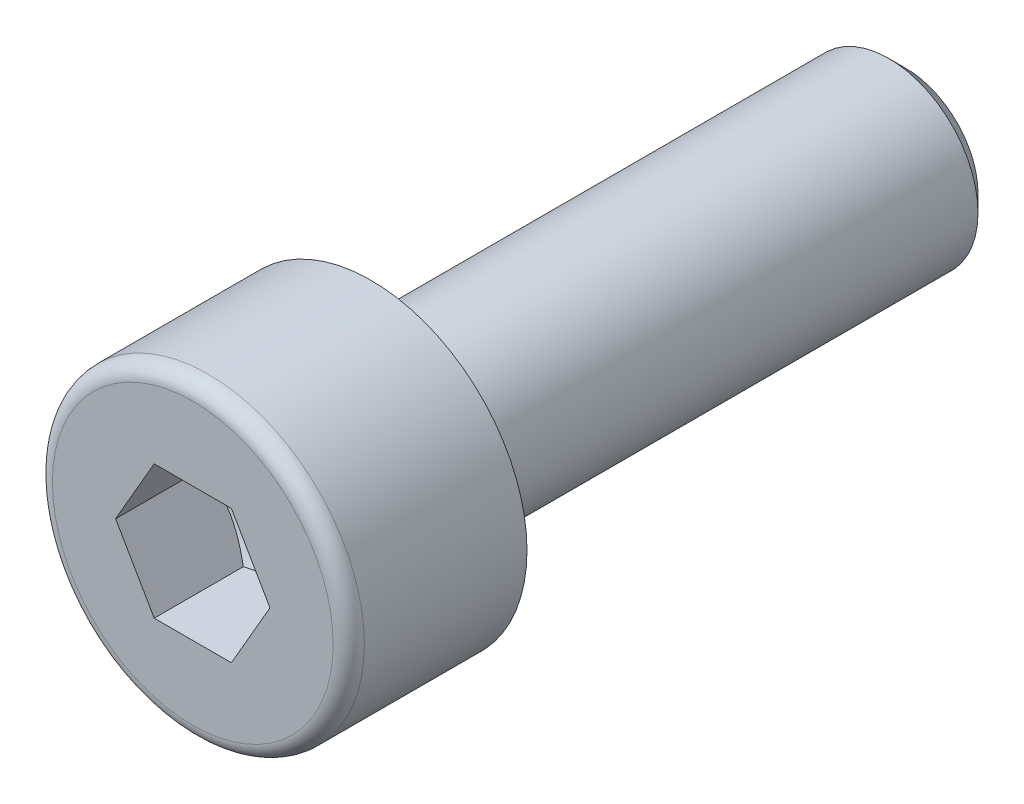
ISO-10303-21;
HEADER;
FILE_DESCRIPTION(('STEP AP214'),'2;1');
FILE_NAME('part.step','',(''),(''),'','','');
FILE_SCHEMA(('AUTOMOTIVE_DESIGN { 1 0 10303 214 1 1 1 1 }'));
ENDSEC;
DATA;
#1=APPLICATION_CONTEXT('core data for automotive mechanical design processes');
#2=APPLICATION_PROTOCOL_DEFINITION('international standard','automotive_design',2000,#1);
#3=PRODUCT_CONTEXT('',#1,'mechanical');
#4=PRODUCT('Part','Part','',(#3));
#5=PRODUCT_RELATED_PRODUCT_CATEGORY('part','',(#4));
#6=PRODUCT_DEFINITION_FORMATION('','',#4);
#7=PRODUCT_DEFINITION_CONTEXT('part definition',#1,'design');
#8=PRODUCT_DEFINITION('design','',#6,#7);
#9=PRODUCT_DEFINITION_SHAPE('','',#8);
#10=(LENGTH_UNIT() NAMED_UNIT(*) SI_UNIT(.MILLI.,.METRE.));
#11=(NAMED_UNIT(*) PLANE_ANGLE_UNIT() SI_UNIT($,.RADIAN.));
#12=(NAMED_UNIT(*) SI_UNIT($,.STERADIAN.) SOLID_ANGLE_UNIT());
#13=UNCERTAINTY_MEASURE_WITH_UNIT(LENGTH_MEASURE(1.E-05),#10,'distance_accuracy_value','');
#14=(GEOMETRIC_REPRESENTATION_CONTEXT(3) GLOBAL_UNCERTAINTY_ASSIGNED_CONTEXT((#13)) GLOBAL_UNIT_ASSIGNED_CONTEXT((#10,
#11,#12)) REPRESENTATION_CONTEXT('',''));
#15=CARTESIAN_POINT('',(0.,0.,0.));
#16=DIRECTION('',(0.,0.,1.));
#17=DIRECTION('',(1.,0.,0.));
#18=AXIS2_PLACEMENT_3D('',#15,#16,#17);
#19=CARTESIAN_POINT('',(0.,3.15,4.));
#20=DIRECTION('',(0.,0.,-1.));
#21=DIRECTION('',(-1.,0.,0.));
#22=AXIS2_PLACEMENT_3D('',#19,#20,#21);
#23=PLANE('',#22);
#24=CARTESIAN_POINT('',(0.,0.,4.));
#25=DIRECTION('',(0.,0.,1.));
#26=DIRECTION('',(1.,0.,0.));
#27=AXIS2_PLACEMENT_3D('',#24,#25,#26);
#28=CIRCLE('',#27,3.15);
#29=CARTESIAN_POINT('',(3.15,0.,4.));
#30=VERTEX_POINT('',#29);
#31=EDGE_CURVE('E125',#30,#30,#28,.T.);
#32=ORIENTED_EDGE('',*,*,#31,.T.);
#33=EDGE_LOOP('',(#32));
#34=FACE_BOUND('',#33,.T.);
#35=DIRECTION('',(0.5,-0.866025403784438,0.));
#36=VECTOR('',#35,1.);
#37=CARTESIAN_POINT('',(0.866025,1.49999930062484,4.));
#38=LINE('',#37,#36);
#39=CARTESIAN_POINT('',(0.866025,1.49999930062484,4.));
#40=VERTEX_POINT('',#39);
#41=CARTESIAN_POINT('',(1.73205,0.,4.));
#42=VERTEX_POINT('',#41);
#43=EDGE_CURVE('E31',#40,#42,#38,.T.);
#44=ORIENTED_EDGE('',*,*,#43,.T.);
#45=DIRECTION('',(-0.5,-0.866025403784439,0.));
#46=VECTOR('',#45,1.);
#47=CARTESIAN_POINT('',(1.73205,0.,4.));
#48=LINE('',#47,#46);
#49=CARTESIAN_POINT('',(0.866025,-1.49999930062484,4.));
#50=VERTEX_POINT('',#49);
#51=EDGE_CURVE('E172',#42,#50,#48,.T.);
#52=ORIENTED_EDGE('',*,*,#51,.T.);
#53=DIRECTION('',(-1.,0.,0.));
#54=VECTOR('',#53,1.);
#55=CARTESIAN_POINT('',(0.866025,-1.49999930062484,4.));
#56=LINE('',#55,#54);
#57=CARTESIAN_POINT('',(-0.866025,-1.49999930062484,4.));
#58=VERTEX_POINT('',#57);
#59=EDGE_CURVE('E177',#50,#58,#56,.T.);
#60=ORIENTED_EDGE('',*,*,#59,.T.);
#61=DIRECTION('',(-0.5,0.866025403784439,0.));
#62=VECTOR('',#61,1.);
#63=CARTESIAN_POINT('',(-0.866025,-1.49999930062484,4.));
#64=LINE('',#63,#62);
#65=CARTESIAN_POINT('',(-1.73205,0.,4.));
#66=VERTEX_POINT('',#65);
#67=EDGE_CURVE('E181',#58,#66,#64,.T.);
#68=ORIENTED_EDGE('',*,*,#67,.T.);
#69=DIRECTION('',(0.5,0.866025403784439,0.));
#70=VECTOR('',#69,1.);
#71=CARTESIAN_POINT('',(-1.73205,0.,4.));
#72=LINE('',#71,#70);
#73=CARTESIAN_POINT('',(-0.866025,1.49999930062484,4.));
#74=VERTEX_POINT('',#73);
#75=EDGE_CURVE('E103',#66,#74,#72,.T.);
#76=ORIENTED_EDGE('',*,*,#75,.T.);
#77=DIRECTION('',(1.,0.,0.));
#78=VECTOR('',#77,1.);
#79=CARTESIAN_POINT('',(-0.866025,1.49999930062484,4.));
#80=LINE('',#79,#78);
#81=EDGE_CURVE('E94',#74,#40,#80,.T.);
#82=ORIENTED_EDGE('',*,*,#81,.T.);
#83=EDGE_LOOP('',(#44,#52,#60,#68,#76,#82));
#84=FACE_BOUND('',#83,.T.);
#85=ADVANCED_FACE('F16',(#34,#84),#23,.F.);
#86=CARTESIAN_POINT('',(0.,0.,0.));
#87=DIRECTION('',(0.,0.,1.));
#88=DIRECTION('',(1.,0.,0.));
#89=AXIS2_PLACEMENT_3D('',#86,#87,#88);
#90=PLANE('',#89);
#91=CARTESIAN_POINT('',(0.,0.,0.));
#92=DIRECTION('',(0.,0.,1.));
#93=DIRECTION('',(1.,0.,0.));
#94=AXIS2_PLACEMENT_3D('',#91,#92,#93);
#95=CIRCLE('',#94,3.5);
#96=CARTESIAN_POINT('',(3.5,0.,0.));
#97=VERTEX_POINT('',#96);
#98=EDGE_CURVE('E24',#97,#97,#95,.T.);
#99=ORIENTED_EDGE('',*,*,#98,.F.);
#100=EDGE_LOOP('',(#99));
#101=FACE_BOUND('',#100,.T.);
#102=CARTESIAN_POINT('',(0.,0.,0.));
#103=DIRECTION('',(0.,0.,1.));
#104=DIRECTION('',(1.,0.,0.));
#105=AXIS2_PLACEMENT_3D('',#102,#103,#104);
#106=CIRCLE('',#105,2.);
#107=CARTESIAN_POINT('',(2.,0.,0.));
#108=VERTEX_POINT('',#107);
#109=EDGE_CURVE('E11',#108,#108,#106,.F.);
#110=ORIENTED_EDGE('',*,*,#109,.F.);
#111=EDGE_LOOP('',(#110));
#112=FACE_BOUND('',#111,.T.);
#113=ADVANCED_FACE('F140',(#101,#112),#90,.F.);
#114=CARTESIAN_POINT('',(0.,0.,4.));
#115=DIRECTION('',(0.,0.,1.));
#116=DIRECTION('',(1.,0.,0.));
#117=AXIS2_PLACEMENT_3D('',#114,#115,#116);
#118=CYLINDRICAL_SURFACE('',#117,3.5);
#119=CARTESIAN_POINT('',(0.,0.,3.65));
#120=DIRECTION('',(0.,0.,1.));
#121=DIRECTION('',(1.,0.,0.));
#122=AXIS2_PLACEMENT_3D('',#119,#120,#121);
#123=CIRCLE('',#122,3.5);
#124=CARTESIAN_POINT('',(3.5,0.,3.65));
#125=VERTEX_POINT('',#124);
#126=EDGE_CURVE('E129',#125,#125,#123,.T.);
#127=ORIENTED_EDGE('',*,*,#126,.F.);
#128=EDGE_LOOP('',(#127));
#129=FACE_BOUND('',#128,.T.);
#130=ORIENTED_EDGE('',*,*,#98,.T.);
#131=EDGE_LOOP('',(#130));
#132=FACE_BOUND('',#131,.T.);
#133=ADVANCED_FACE('F138',(#129,#132),#118,.T.);
#134=CARTESIAN_POINT('',(0.,0.,3.65));
#135=DIRECTION('',(0.,0.,1.));
#136=DIRECTION('',(1.,0.,0.));
#137=AXIS2_PLACEMENT_3D('',#134,#135,#136);
#138=TOROIDAL_SURFACE('',#137,3.15,0.35);
#139=ORIENTED_EDGE('',*,*,#31,.F.);
#140=EDGE_LOOP('',(#139));
#141=FACE_BOUND('',#140,.T.);
#142=ORIENTED_EDGE('',*,*,#126,.T.);
#143=EDGE_LOOP('',(#142));
#144=FACE_BOUND('',#143,.T.);
#145=ADVANCED_FACE('F148',(#141,#144),#138,.T.);
#146=CARTESIAN_POINT('',(0.,0.,0.));
#147=DIRECTION('',(0.,0.,1.));
#148=DIRECTION('',(1.,0.,0.));
#149=AXIS2_PLACEMENT_3D('',#146,#147,#148);
#150=CYLINDRICAL_SURFACE('',#149,2.);
#151=CARTESIAN_POINT('',(0.,0.,-11.621125));
#152=DIRECTION('',(0.,0.,1.));
#153=DIRECTION('',(1.,0.,0.));
#154=AXIS2_PLACEMENT_3D('',#151,#152,#153);
#155=CIRCLE('',#154,2.);
#156=CARTESIAN_POINT('',(2.,0.,-11.621125));
#157=VERTEX_POINT('',#156);
#158=EDGE_CURVE('E117',#157,#157,#155,.T.);
#159=ORIENTED_EDGE('',*,*,#158,.T.);
#160=EDGE_LOOP('',(#159));
#161=FACE_BOUND('',#160,.T.);
#162=ORIENTED_EDGE('',*,*,#109,.T.);
#163=EDGE_LOOP('',(#162));
#164=FACE_BOUND('',#163,.T.);
#165=ADVANCED_FACE('F145',(#161,#164),#150,.T.);
#166=CARTESIAN_POINT('',(0.,0.,-12.));
#167=DIRECTION('',(0.,0.,1.));
#168=DIRECTION('',(1.,0.,0.));
#169=AXIS2_PLACEMENT_3D('',#166,#167,#168);
#170=PLANE('',#169);
#171=CARTESIAN_POINT('',(0.,0.,-12.));
#172=DIRECTION('',(0.,0.,1.));
#173=DIRECTION('',(1.,0.,0.));
#174=AXIS2_PLACEMENT_3D('',#171,#172,#173);
#175=CIRCLE('',#174,1.621125);
#176=CARTESIAN_POINT('',(1.621125,0.,-12.));
#177=VERTEX_POINT('',#176);
#178=EDGE_CURVE('E121',#177,#177,#175,.T.);
#179=ORIENTED_EDGE('',*,*,#178,.F.);
#180=EDGE_LOOP('',(#179));
#181=FACE_BOUND('',#180,.T.);
#182=ADVANCED_FACE('F147',(#181),#170,.F.);
#183=CARTESIAN_POINT('',(0.,0.,-12.));
#184=DIRECTION('',(0.,0.,1.));
#185=DIRECTION('',(1.,0.,0.));
#186=AXIS2_PLACEMENT_3D('',#183,#184,#185);
#187=CONICAL_SURFACE('',#186,1.621125,0.785398163397445);
#188=ORIENTED_EDGE('',*,*,#158,.F.);
#189=EDGE_LOOP('',(#188));
#190=FACE_BOUND('',#189,.T.);
#191=ORIENTED_EDGE('',*,*,#178,.T.);
#192=EDGE_LOOP('',(#191));
#193=FACE_BOUND('',#192,.T.);
#194=ADVANCED_FACE('F156',(#190,#193),#187,.T.);
#195=CARTESIAN_POINT('',(0.866025,1.49999930062484,1.00000046625011));
#196=DIRECTION('',(-0.866025403784438,-0.5,0.));
#197=DIRECTION('',(-0.5,0.866025403784438,0.));
#198=AXIS2_PLACEMENT_3D('',#195,#196,#197);
#199=PLANE('',#198);
#200=DIRECTION('',(0.,0.,1.));
#201=VECTOR('',#200,1.);
#202=CARTESIAN_POINT('',(1.73205,0.,1.00000046625011));
#203=LINE('',#202,#201);
#204=CARTESIAN_POINT('',(1.73205,0.,2.));
#205=VERTEX_POINT('',#204);
#206=EDGE_CURVE('E115',#205,#42,#203,.T.);
#207=ORIENTED_EDGE('',*,*,#206,.T.);
#208=ORIENTED_EDGE('',*,*,#43,.F.);
#209=DIRECTION('',(0.,0.,1.));
#210=VECTOR('',#209,1.);
#211=CARTESIAN_POINT('',(0.866025,1.49999930062484,1.00000046625011));
#212=LINE('',#211,#210);
#213=CARTESIAN_POINT('',(0.866025,1.49999930062484,2.));
#214=VERTEX_POINT('',#213);
#215=EDGE_CURVE('E87',#214,#40,#212,.T.);
#216=ORIENTED_EDGE('',*,*,#215,.F.);
#217=CARTESIAN_POINT('',(1.73205115470054,-2.E-06,2.00000066666734));
#218=CARTESIAN_POINT('',(1.69399458130122,0.0659139186895892,1.97802228100261));
#219=CARTESIAN_POINT('',(1.65560950414464,0.132398822577242,1.95803408114054));
#220=CARTESIAN_POINT('',(1.57817473630843,0.266519774741864,1.92314525941874));
#221=CARTESIAN_POINT('',(1.53912367019894,0.334158205333232,1.90825697858766));
#222=CARTESIAN_POINT('',(1.46150547885139,0.468596856338784,1.88508226983918));
#223=CARTESIAN_POINT('',(1.42295029290091,0.535376397300293,1.87664158385231));
#224=CARTESIAN_POINT('',(1.34565859846878,0.669249539059823,1.86656700525616));
#225=CARTESIAN_POINT('',(1.30692237073331,0.736342653591208,1.86492476807133));
#226=CARTESIAN_POINT('',(1.23454773253413,0.861699204131607,1.86834969801067));
#227=CARTESIAN_POINT('',(1.20089846229767,0.919981449818777,1.87257593125167));
#228=CARTESIAN_POINT('',(1.1338191361032,1.03616625092508,1.88596796669928));
#229=CARTESIAN_POINT('',(1.10038931198579,1.09406840478452,1.89513833923059));
#230=CARTESIAN_POINT('',(1.03317179328088,1.21049256234014,1.91806252128818));
#231=CARTESIAN_POINT('',(0.999392601793287,1.26899983823525,1.93191346069662));
#232=CARTESIAN_POINT('',(0.932337893068965,1.38514200063251,1.96334924731355));
#233=CARTESIAN_POINT('',(0.89906151743008,1.4427783739308,1.980926712986));
#234=CARTESIAN_POINT('',(0.866023845299461,1.50000130062484,2.00000066666734));
#235=B_SPLINE_CURVE_WITH_KNOTS('',3,(#217,#218,#219,#220,#221,#222,#223,#224,#225,#226,#227,
#228,#229,#230,#231,#232,#233,#234),.UNSPECIFIED.,.F.,.F.,(4,2,2,2,2,2,2,2,4),(0.,
0.237762055931485,0.476095461361748,0.708530837844131,0.94068083294838,1.14278193102308,
1.34507017093339,1.55184422617205,1.75821246569164),.UNSPECIFIED.);
#236=EDGE_CURVE('E79',#205,#214,#235,.T.);
#237=ORIENTED_EDGE('',*,*,#236,.F.);
#238=EDGE_LOOP('',(#207,#208,#216,#237));
#239=FACE_BOUND('',#238,.T.);
#240=ADVANCED_FACE('F88',(#239),#199,.T.);
#241=CARTESIAN_POINT('',(1.73205,0.,1.00000046625011));
#242=DIRECTION('',(-0.866025403784439,0.5,0.));
#243=DIRECTION('',(0.5,0.866025403784439,0.));
#244=AXIS2_PLACEMENT_3D('',#241,#242,#243);
#245=PLANE('',#244);
#246=DIRECTION('',(0.,0.,1.));
#247=VECTOR('',#246,1.);
#248=CARTESIAN_POINT('',(0.866025,-1.49999930062484,1.00000046625011));
#249=LINE('',#248,#247);
#250=CARTESIAN_POINT('',(0.866025,-1.49999930062484,2.));
#251=VERTEX_POINT('',#250);
#252=EDGE_CURVE('E112',#251,#50,#249,.T.);
#253=ORIENTED_EDGE('',*,*,#252,.T.);
#254=ORIENTED_EDGE('',*,*,#51,.F.);
#255=ORIENTED_EDGE('',*,*,#206,.F.);
#256=CARTESIAN_POINT('',(0.866023845299462,-1.50000130062484,2.00000066666734));
#257=CARTESIAN_POINT('',(0.904080418698778,-1.43408538193525,1.9780222810026));
#258=CARTESIAN_POINT('',(0.942465495855361,-1.36760047804759,1.95803408114054));
#259=CARTESIAN_POINT('',(1.01990026369157,-1.23347952588297,1.92314525941874));
#260=CARTESIAN_POINT('',(1.05895132980106,-1.1658410952916,1.90825697858766));
#261=CARTESIAN_POINT('',(1.13656952114861,-1.03140244428605,1.88508226983918));
#262=CARTESIAN_POINT('',(1.1751247070991,-0.964622903324544,1.87664158385231));
#263=CARTESIAN_POINT('',(1.25241640153122,-0.830749761565014,1.86656700525616));
#264=CARTESIAN_POINT('',(1.29115262926669,-0.763656647033629,1.86492476807133));
#265=CARTESIAN_POINT('',(1.36352726746587,-0.638300096493229,1.86834969801067));
#266=CARTESIAN_POINT('',(1.39717653770233,-0.58001785080606,1.87257593125166));
#267=CARTESIAN_POINT('',(1.4642558638968,-0.463833049699756,1.88596796669928));
#268=CARTESIAN_POINT('',(1.49768568801421,-0.405930895840313,1.89513833923059));
#269=CARTESIAN_POINT('',(1.56490320671912,-0.2895067382847,1.91806252128818));
#270=CARTESIAN_POINT('',(1.59868239820671,-0.230999462389588,1.93191346069662));
#271=CARTESIAN_POINT('',(1.66573710693103,-0.11485729999233,1.96334924731355));
#272=CARTESIAN_POINT('',(1.69901348256992,-0.0572209266940348,1.980926712986));
#273=CARTESIAN_POINT('',(1.73205115470054,1.99999999979098E-06,2.00000066666734));
#274=B_SPLINE_CURVE_WITH_KNOTS('',3,(#256,#257,#258,#259,#260,#261,#262,#263,#264,#265,#266,
#267,#268,#269,#270,#271,#272,#273),.UNSPECIFIED.,.F.,.F.,(4,2,2,2,2,2,2,2,4),(0.,
0.237762055931484,0.476095461361747,0.708530837844129,0.940680832948377,1.14278193102307,
1.34507017093338,1.55184422617205,1.75821246569164),.UNSPECIFIED.);
#275=EDGE_CURVE('E83',#251,#205,#274,.T.);
#276=ORIENTED_EDGE('',*,*,#275,.F.);
#277=EDGE_LOOP('',(#253,#254,#255,#276));
#278=FACE_BOUND('',#277,.T.);
#279=ADVANCED_FACE('F237',(#278),#245,.T.);
#280=CARTESIAN_POINT('',(0.866025,-1.49999930062484,1.00000046625011));
#281=DIRECTION('',(0.,1.,0.));
#282=DIRECTION('',(1.,0.,0.));
#283=AXIS2_PLACEMENT_3D('',#280,#281,#282);
#284=PLANE('',#283);
#285=DIRECTION('',(0.,0.,1.));
#286=VECTOR('',#285,1.);
#287=CARTESIAN_POINT('',(-0.866025,-1.49999930062484,1.00000046625011));
#288=LINE('',#287,#286);
#289=CARTESIAN_POINT('',(-0.866025,-1.49999930062484,2.));
#290=VERTEX_POINT('',#289);
#291=EDGE_CURVE('E109',#290,#58,#288,.T.);
#292=ORIENTED_EDGE('',*,*,#291,.T.);
#293=ORIENTED_EDGE('',*,*,#59,.F.);
#294=ORIENTED_EDGE('',*,*,#252,.F.);
#295=CARTESIAN_POINT('',(-2.24271663728987,-1.49999930062484,2.55775267344395));
#296=CARTESIAN_POINT('',(-2.17794141332338,-1.49999930062484,2.52667596135368));
#297=CARTESIAN_POINT('',(-2.11300852130655,-1.49999930062484,2.49592211621229));
#298=CARTESIAN_POINT('',(-1.98274303131292,-1.49999930062484,2.43524311162405));
#299=CARTESIAN_POINT('',(-1.91741036395219,-1.49999930062484,2.40531810131238));
#300=CARTESIAN_POINT('',(-1.78588635397686,-1.49999930062484,2.34631254095844));
#301=CARTESIAN_POINT('',(-1.71969220663993,-1.49999930062484,2.31723821458641));
#302=CARTESIAN_POINT('',(-1.58674953026847,-1.49999930062484,2.26039396688304));
#303=CARTESIAN_POINT('',(-1.52000103027226,-1.49999930062484,2.23262397772829));
#304=CARTESIAN_POINT('',(-1.38408036083489,-1.49999930062484,2.17802545642731));
#305=CARTESIAN_POINT('',(-1.31489044686774,-1.49999930062484,2.1512405113674));
#306=CARTESIAN_POINT('',(-1.17568875836751,-1.49999930062484,2.09990652822181));
#307=CARTESIAN_POINT('',(-1.10567688208708,-1.49999930062484,2.07535777031023));
#308=CARTESIAN_POINT('',(-0.894522216300188,-1.49999930062484,2.0061010834001));
#309=CARTESIAN_POINT('',(-0.751873977094198,-1.49999930062484,1.9656202744164));
#310=CARTESIAN_POINT('',(-0.535047450977606,-1.49999930062484,1.9186645261203));
#311=CARTESIAN_POINT('',(-0.462365424606466,-1.49999930062484,1.90531291688069));
#312=CARTESIAN_POINT('',(-0.316183762847225,-1.49999930062484,1.8841134767258));
#313=CARTESIAN_POINT('',(-0.242684183051902,-1.49999930062484,1.87626527388084));
#314=CARTESIAN_POINT('',(-0.0961588910059515,-1.49999930062484,1.86679859934064));
#315=CARTESIAN_POINT('',(-0.0231380525234333,-1.49999930062484,1.86510661239957));
#316=CARTESIAN_POINT('',(0.122783022434076,-1.49999930062484,1.86789948707645));
#317=CARTESIAN_POINT('',(0.195683251161583,-1.49999930062484,1.8723847311637));
#318=CARTESIAN_POINT('',(0.375553746438775,-1.49999930062484,1.89067768491976));
#319=CARTESIAN_POINT('',(0.4821754471692,-1.49999930062484,1.90791354190592));
#320=CARTESIAN_POINT('',(0.693345462539466,-1.49999930062484,1.95235984396466));
#321=CARTESIAN_POINT('',(0.79789111749796,-1.49999930062484,1.97958231080908));
#322=CARTESIAN_POINT('',(0.954250638010105,-1.49999930062484,2.02608493590371));
#323=CARTESIAN_POINT('',(1.00687274480645,-1.49999930062484,2.04274751774646));
#324=CARTESIAN_POINT('',(1.11156919647057,-1.49999930062484,2.07761406562061));
#325=CARTESIAN_POINT('',(1.16364386068557,-1.49999930062484,2.09581706970924));
#326=CARTESIAN_POINT('',(1.26731501755411,-1.49999930062484,2.13350010092581));
#327=CARTESIAN_POINT('',(1.31891159517315,-1.49999930062484,2.15297989597396));
#328=CARTESIAN_POINT('',(1.42169818698628,-1.49999930062484,2.19300580386973));
#329=CARTESIAN_POINT('',(1.47288813079445,-1.49999930062484,2.21355209687612));
#330=CARTESIAN_POINT('',(1.6035520536722,-1.49999930062484,2.26731329701247));
#331=CARTESIAN_POINT('',(1.68276476914258,-1.49999930062484,2.30116251352867));
#332=CARTESIAN_POINT('',(1.84047488481565,-1.49999930062484,2.37049266735));
#333=CARTESIAN_POINT('',(1.9189722309026,-1.49999930062484,2.40597372689195));
#334=CARTESIAN_POINT('',(2.15362957255391,-1.49999930062484,2.51428942992019));
#335=CARTESIAN_POINT('',(2.3089286607519,-1.49999930062484,2.58898549353906));
#336=CARTESIAN_POINT('',(2.61820006623532,-1.49999930062484,2.74151036059574));
#337=CARTESIAN_POINT('',(2.77217051778771,-1.49999930062484,2.81934290231597));
#338=CARTESIAN_POINT('',(3.07905650209162,-1.49999930062484,2.97700931547993));
#339=CARTESIAN_POINT('',(3.23197216581148,-1.49999930062484,3.05684293253984));
#340=CARTESIAN_POINT('',(3.52267476728495,-1.49999930062484,3.21028853935711));
#341=CARTESIAN_POINT('',(3.66052737206612,-1.49999930062484,3.28377655462836));
#342=CARTESIAN_POINT('',(3.93578914881928,-1.49999930062484,3.43158990958268));
#343=CARTESIAN_POINT('',(4.07319830413762,-1.49999930062484,3.50591528025237));
#344=CARTESIAN_POINT('',(4.34732590427536,-1.49999930062483,3.65500351537988));
#345=CARTESIAN_POINT('',(4.48404521696312,-1.49999930062483,3.72976478622522));
#346=CARTESIAN_POINT('',(4.75720742747683,-1.49999930062483,3.87977391809883));
#347=CARTESIAN_POINT('',(4.89365033939364,-1.49999930062484,3.9550217534582));
#348=CARTESIAN_POINT('',(5.02999394665514,-1.49999930062484,4.03044801324502));
#349=B_SPLINE_CURVE_WITH_KNOTS('',3,(#295,#296,#297,#298,#299,#300,#301,#302,#303,#304,#305,
#306,#307,#308,#309,#310,#311,#312,#313,#314,#315,#316,#317,#318,#319,#320,#321,#322,#323,#324,
#325,#326,#327,#328,#329,#330,#331,#332,#333,#334,#335,#336,#337,#338,#339,#340,#341,#342,#343,
#344,#345,#346,#347,#348),.UNSPECIFIED.,.F.,.F.,(4,2,2,2,2,2,2,2,2,2,2,2,2,2,2,2,2,2,2,2,2,2,2,
2,2,2,4),(0.,0.215535408976475,0.431109351318747,0.647990972858705,0.864861304394723,
1.08740082372431,1.30996818700982,1.75384735851117,1.97537373294937,2.19688513480997,
2.41574248382684,2.63461338422016,2.95796620171825,3.28170955197757,3.44728283297626,
3.61275347131505,3.77819411534645,3.94366279806486,4.20206179692704,4.46048018336434,
4.97740230798824,5.49495989978084,6.01245202818902,6.48110050133562,6.94976637432356,
7.41724019162004,7.88468954517039),.UNSPECIFIED.);
#350=EDGE_CURVE('E225',#290,#251,#349,.T.);
#351=ORIENTED_EDGE('',*,*,#350,.F.);
#352=EDGE_LOOP('',(#292,#293,#294,#351));
#353=FACE_BOUND('',#352,.T.);
#354=ADVANCED_FACE('F232',(#353),#284,.T.);
#355=CARTESIAN_POINT('',(-0.866025,-1.49999930062484,1.00000046625011));
#356=DIRECTION('',(0.866025403784439,0.5,0.));
#357=DIRECTION('',(0.5,-0.866025403784439,0.));
#358=AXIS2_PLACEMENT_3D('',#355,#356,#357);
#359=PLANE('',#358);
#360=DIRECTION('',(0.,0.,1.));
#361=VECTOR('',#360,1.);
#362=CARTESIAN_POINT('',(-1.73205,0.,1.00000046625011));
#363=LINE('',#362,#361);
#364=CARTESIAN_POINT('',(-1.73205,0.,2.));
#365=VERTEX_POINT('',#364);
#366=EDGE_CURVE('E100',#365,#66,#363,.T.);
#367=ORIENTED_EDGE('',*,*,#366,.T.);
#368=ORIENTED_EDGE('',*,*,#67,.F.);
#369=ORIENTED_EDGE('',*,*,#291,.F.);
#370=CARTESIAN_POINT('',(-1.73205115470054,1.99999999935948E-06,2.00000066666734));
#371=CARTESIAN_POINT('',(-1.69399458130122,-0.0659139186895897,1.97802228100261));
#372=CARTESIAN_POINT('',(-1.65560950414464,-0.132398822577242,1.95803408114054));
#373=CARTESIAN_POINT('',(-1.57817473630843,-0.266519774741865,1.92314525941874));
#374=CARTESIAN_POINT('',(-1.53912367019894,-0.334158205333233,1.90825697858766));
#375=CARTESIAN_POINT('',(-1.46150547885139,-0.468596856338785,1.88508226983918));
#376=CARTESIAN_POINT('',(-1.4229502929009,-0.535376397300293,1.87664158385231));
#377=CARTESIAN_POINT('',(-1.34565859846878,-0.669249539059823,1.86656700525616));
#378=CARTESIAN_POINT('',(-1.30692237073331,-0.736342653591209,1.86492476807133));
#379=CARTESIAN_POINT('',(-1.23454773253413,-0.861699204131608,1.86834969801067));
#380=CARTESIAN_POINT('',(-1.20089846229767,-0.919981449818777,1.87257593125166));
#381=CARTESIAN_POINT('',(-1.1338191361032,-1.03616625092508,1.88596796669928));
#382=CARTESIAN_POINT('',(-1.10038931198579,-1.09406840478452,1.89513833923059));
#383=CARTESIAN_POINT('',(-1.03317179328088,-1.21049256234014,1.91806252128818));
#384=CARTESIAN_POINT('',(-0.999392601793289,-1.26899983823525,1.93191346069662));
#385=CARTESIAN_POINT('',(-0.932337893068967,-1.38514200063251,1.96334924731355));
#386=CARTESIAN_POINT('',(-0.899061517430081,-1.4427783739308,1.980926712986));
#387=CARTESIAN_POINT('',(-0.866023845299461,-1.50000130062484,2.00000066666734));
#388=B_SPLINE_CURVE_WITH_KNOTS('',3,(#370,#371,#372,#373,#374,#375,#376,#377,#378,#379,#380,
#381,#382,#383,#384,#385,#386,#387),.UNSPECIFIED.,.F.,.F.,(4,2,2,2,2,2,2,2,4),(0.,
0.237762055931485,0.476095461361749,0.708530837844132,0.94068083294838,1.14278193102308,
1.34507017093338,1.55184422617205,1.75821246569164),.UNSPECIFIED.);
#389=EDGE_CURVE('E218',#365,#290,#388,.T.);
#390=ORIENTED_EDGE('',*,*,#389,.F.);
#391=EDGE_LOOP('',(#367,#368,#369,#390));
#392=FACE_BOUND('',#391,.T.);
#393=ADVANCED_FACE('F201',(#392),#359,.T.);
#394=CARTESIAN_POINT('',(-1.73205,0.,1.00000046625011));
#395=DIRECTION('',(0.866025403784439,-0.5,0.));
#396=DIRECTION('',(-0.5,-0.866025403784439,0.));
#397=AXIS2_PLACEMENT_3D('',#394,#395,#396);
#398=PLANE('',#397);
#399=DIRECTION('',(0.,0.,1.));
#400=VECTOR('',#399,1.);
#401=CARTESIAN_POINT('',(-0.866025,1.49999930062484,1.00000046625011));
#402=LINE('',#401,#400);
#403=CARTESIAN_POINT('',(-0.866025,1.49999930062484,2.));
#404=VERTEX_POINT('',#403);
#405=EDGE_CURVE('E93',#404,#74,#402,.T.);
#406=ORIENTED_EDGE('',*,*,#405,.T.);
#407=ORIENTED_EDGE('',*,*,#75,.F.);
#408=ORIENTED_EDGE('',*,*,#366,.F.);
#409=CARTESIAN_POINT('',(-0.866023845299462,1.50000130062484,2.00000066666734));
#410=CARTESIAN_POINT('',(-0.904080418698778,1.43408538193525,1.9780222810026));
#411=CARTESIAN_POINT('',(-0.942465495855361,1.36760047804759,1.95803408114054));
#412=CARTESIAN_POINT('',(-1.01990026369157,1.23347952588297,1.92314525941874));
#413=CARTESIAN_POINT('',(-1.05895132980106,1.1658410952916,1.90825697858766));
#414=CARTESIAN_POINT('',(-1.13656952114861,1.03140244428605,1.88508226983918));
#415=CARTESIAN_POINT('',(-1.1751247070991,0.964622903324544,1.87664158385231));
#416=CARTESIAN_POINT('',(-1.25241640153122,0.830749761565014,1.86656700525616));
#417=CARTESIAN_POINT('',(-1.29115262926669,0.763656647033629,1.86492476807133));
#418=CARTESIAN_POINT('',(-1.36352726746587,0.638300096493229,1.86834969801067));
#419=CARTESIAN_POINT('',(-1.39717653770233,0.58001785080606,1.87257593125166));
#420=CARTESIAN_POINT('',(-1.4642558638968,0.463833049699756,1.88596796669928));
#421=CARTESIAN_POINT('',(-1.49768568801421,0.405930895840313,1.89513833923059));
#422=CARTESIAN_POINT('',(-1.56490320671912,0.289506738284699,1.91806252128818));
#423=CARTESIAN_POINT('',(-1.59868239820671,0.230999462389588,1.93191346069662));
#424=CARTESIAN_POINT('',(-1.66573710693103,0.11485729999233,1.96334924731355));
#425=CARTESIAN_POINT('',(-1.69901348256992,0.0572209266940344,1.980926712986));
#426=CARTESIAN_POINT('',(-1.73205115470054,-2.00000000048508E-06,2.00000066666734));
#427=B_SPLINE_CURVE_WITH_KNOTS('',3,(#409,#410,#411,#412,#413,#414,#415,#416,#417,#418,#419,
#420,#421,#422,#423,#424,#425,#426),.UNSPECIFIED.,.F.,.F.,(4,2,2,2,2,2,2,2,4),(0.,
0.237762055931484,0.476095461361747,0.708530837844129,0.940680832948377,1.14278193102307,
1.34507017093338,1.55184422617205,1.75821246569164),.UNSPECIFIED.);
#428=EDGE_CURVE('E39',#404,#365,#427,.T.);
#429=ORIENTED_EDGE('',*,*,#428,.F.);
#430=EDGE_LOOP('',(#406,#407,#408,#429));
#431=FACE_BOUND('',#430,.T.);
#432=ADVANCED_FACE('F195',(#431),#398,.T.);
#433=CARTESIAN_POINT('',(-0.866025,1.49999930062484,1.00000046625011));
#434=DIRECTION('',(0.,-1.,0.));
#435=DIRECTION('',(-1.,0.,0.));
#436=AXIS2_PLACEMENT_3D('',#433,#434,#435);
#437=PLANE('',#436);
#438=ORIENTED_EDGE('',*,*,#215,.T.);
#439=ORIENTED_EDGE('',*,*,#81,.F.);
#440=ORIENTED_EDGE('',*,*,#405,.F.);
#441=CARTESIAN_POINT('',(-2.24271663728987,1.49999930062484,2.55775267344395));
#442=CARTESIAN_POINT('',(-2.17794141332338,1.49999930062484,2.52667596135368));
#443=CARTESIAN_POINT('',(-2.11300852130655,1.49999930062484,2.49592211621229));
#444=CARTESIAN_POINT('',(-1.98274303131292,1.49999930062484,2.43524311162405));
#445=CARTESIAN_POINT('',(-1.91741036395219,1.49999930062484,2.40531810131238));
#446=CARTESIAN_POINT('',(-1.78588635397687,1.49999930062484,2.34631254095844));
#447=CARTESIAN_POINT('',(-1.71969220663993,1.49999930062484,2.31723821458641));
#448=CARTESIAN_POINT('',(-1.58674953026847,1.49999930062484,2.26039396688304));
#449=CARTESIAN_POINT('',(-1.52000103027226,1.49999930062484,2.23262397772829));
#450=CARTESIAN_POINT('',(-1.3840803608349,1.49999930062484,2.17802545642731));
#451=CARTESIAN_POINT('',(-1.31489044686775,1.49999930062484,2.1512405113674));
#452=CARTESIAN_POINT('',(-1.17568875836751,1.49999930062484,2.09990652822181));
#453=CARTESIAN_POINT('',(-1.10567688208708,1.49999930062484,2.07535777031023));
#454=CARTESIAN_POINT('',(-0.894522216300189,1.49999930062484,2.0061010834001));
#455=CARTESIAN_POINT('',(-0.751873977094199,1.49999930062484,1.9656202744164));
#456=CARTESIAN_POINT('',(-0.535047450977607,1.49999930062484,1.9186645261203));
#457=CARTESIAN_POINT('',(-0.462365424606467,1.49999930062484,1.90531291688069));
#458=CARTESIAN_POINT('',(-0.316183762847226,1.49999930062484,1.8841134767258));
#459=CARTESIAN_POINT('',(-0.242684183051903,1.49999930062484,1.87626527388084));
#460=CARTESIAN_POINT('',(-0.0961588910059524,1.49999930062484,1.86679859934064));
#461=CARTESIAN_POINT('',(-0.0231380525234342,1.49999930062484,1.86510661239957));
#462=CARTESIAN_POINT('',(0.122783022434075,1.49999930062484,1.86789948707645));
#463=CARTESIAN_POINT('',(0.195683251161582,1.49999930062484,1.8723847311637));
#464=CARTESIAN_POINT('',(0.375553746438774,1.49999930062484,1.89067768491976));
#465=CARTESIAN_POINT('',(0.482175447169199,1.49999930062484,1.90791354190592));
#466=CARTESIAN_POINT('',(0.693345462539464,1.49999930062484,1.95235984396466));
#467=CARTESIAN_POINT('',(0.797891117497957,1.49999930062484,1.97958231080908));
#468=CARTESIAN_POINT('',(0.954250638010102,1.49999930062484,2.02608493590371));
#469=CARTESIAN_POINT('',(1.00687274480645,1.49999930062484,2.04274751774646));
#470=CARTESIAN_POINT('',(1.11156919647056,1.49999930062484,2.07761406562061));
#471=CARTESIAN_POINT('',(1.16364386068556,1.49999930062484,2.09581706970924));
#472=CARTESIAN_POINT('',(1.2673150175541,1.49999930062484,2.13350010092581));
#473=CARTESIAN_POINT('',(1.31891159517315,1.49999930062484,2.15297989597396));
#474=CARTESIAN_POINT('',(1.42169818698628,1.49999930062484,2.19300580386972));
#475=CARTESIAN_POINT('',(1.47288813079445,1.49999930062484,2.21355209687612));
#476=CARTESIAN_POINT('',(1.60355205367219,1.49999930062484,2.26731329701247));
#477=CARTESIAN_POINT('',(1.68276476914257,1.49999930062484,2.30116251352867));
#478=CARTESIAN_POINT('',(1.84047488481565,1.49999930062484,2.37049266735));
#479=CARTESIAN_POINT('',(1.91897223090259,1.49999930062484,2.40597372689195));
#480=CARTESIAN_POINT('',(2.15362957255391,1.49999930062484,2.51428942992019));
#481=CARTESIAN_POINT('',(2.30892866075189,1.49999930062484,2.58898549353906));
#482=CARTESIAN_POINT('',(2.61820006623532,1.49999930062484,2.74151036059574));
#483=CARTESIAN_POINT('',(2.77217051778771,1.49999930062484,2.81934290231597));
#484=CARTESIAN_POINT('',(3.07905650209162,1.49999930062484,2.97700931547993));
#485=CARTESIAN_POINT('',(3.23197216581148,1.49999930062484,3.05684293253984));
#486=CARTESIAN_POINT('',(3.52267476728495,1.49999930062484,3.21028853935711));
#487=CARTESIAN_POINT('',(3.66052737206611,1.49999930062484,3.28377655462836));
#488=CARTESIAN_POINT('',(3.93578914881928,1.49999930062484,3.43158990958268));
#489=CARTESIAN_POINT('',(4.07319830413762,1.49999930062484,3.50591528025237));
#490=CARTESIAN_POINT('',(4.34732590427536,1.49999930062484,3.65500351537988));
#491=CARTESIAN_POINT('',(4.48404521696312,1.49999930062484,3.72976478622523));
#492=CARTESIAN_POINT('',(4.75720742747683,1.49999930062484,3.87977391809883));
#493=CARTESIAN_POINT('',(4.89365033939364,1.49999930062484,3.9550217534582));
#494=CARTESIAN_POINT('',(5.02999394665514,1.49999930062484,4.03044801324502));
#495=B_SPLINE_CURVE_WITH_KNOTS('',3,(#441,#442,#443,#444,#445,#446,#447,#448,#449,#450,#451,
#452,#453,#454,#455,#456,#457,#458,#459,#460,#461,#462,#463,#464,#465,#466,#467,#468,#469,#470,
#471,#472,#473,#474,#475,#476,#477,#478,#479,#480,#481,#482,#483,#484,#485,#486,#487,#488,#489,
#490,#491,#492,#493,#494),.UNSPECIFIED.,.F.,.F.,(4,2,2,2,2,2,2,2,2,2,2,2,2,2,2,2,2,2,2,2,2,2,2,
2,2,2,4),(0.,0.215535408976474,0.431109351318746,0.647990972858704,0.864861304394721,
1.0874008237243,1.30996818700982,1.75384735851117,1.97537373294937,2.19688513480997,
2.41574248382684,2.63461338422015,2.95796620171825,3.28170955197757,3.44728283297626,
3.61275347131505,3.77819411534645,3.94366279806485,4.20206179692704,4.46048018336433,
4.97740230798824,5.49495989978084,6.01245202818902,6.48110050133561,6.94976637432355,
7.41724019162004,7.88468954517039),.UNSPECIFIED.);
#496=EDGE_CURVE('E80',#214,#404,#495,.F.);
#497=ORIENTED_EDGE('',*,*,#496,.F.);
#498=EDGE_LOOP('',(#438,#439,#440,#497));
#499=FACE_BOUND('',#498,.T.);
#500=ADVANCED_FACE('F75',(#499),#437,.T.);
#501=CARTESIAN_POINT('',(0.,0.,1.00000046625011));
#502=DIRECTION('',(0.,0.,1.));
#503=DIRECTION('',(1.,0.,0.));
#504=AXIS2_PLACEMENT_3D('',#501,#502,#503);
#505=CONICAL_SURFACE('',#504,0.,1.0471975511966);
#506=CARTESIAN_POINT('',(0.,0.,1.00000046625011));
#507=VERTEX_POINT('',#506);
#508=VERTEX_LOOP('',#507);
#509=FACE_BOUND('',#508,.T.);
#510=ORIENTED_EDGE('',*,*,#236,.T.);
#511=ORIENTED_EDGE('',*,*,#496,.T.);
#512=ORIENTED_EDGE('',*,*,#428,.T.);
#513=ORIENTED_EDGE('',*,*,#389,.T.);
#514=ORIENTED_EDGE('',*,*,#350,.T.);
#515=ORIENTED_EDGE('',*,*,#275,.T.);
#516=EDGE_LOOP('',(#510,#511,#512,#513,#514,#515));
#517=FACE_BOUND('',#516,.T.);
#518=ADVANCED_FACE('F72',(#509,#517),#505,.F.);
#519=CLOSED_SHELL('',(#85,#113,#133,#145,#165,#182,#194,#240,#279,#354,#393,#432,#500,#518));
#520=MANIFOLD_SOLID_BREP('B1',#519);
#521=ADVANCED_BREP_SHAPE_REPRESENTATION('',(#18,#520),#14);
#522=SHAPE_DEFINITION_REPRESENTATION(#9,#521);
ENDSEC;
END-ISO-10303-21;
